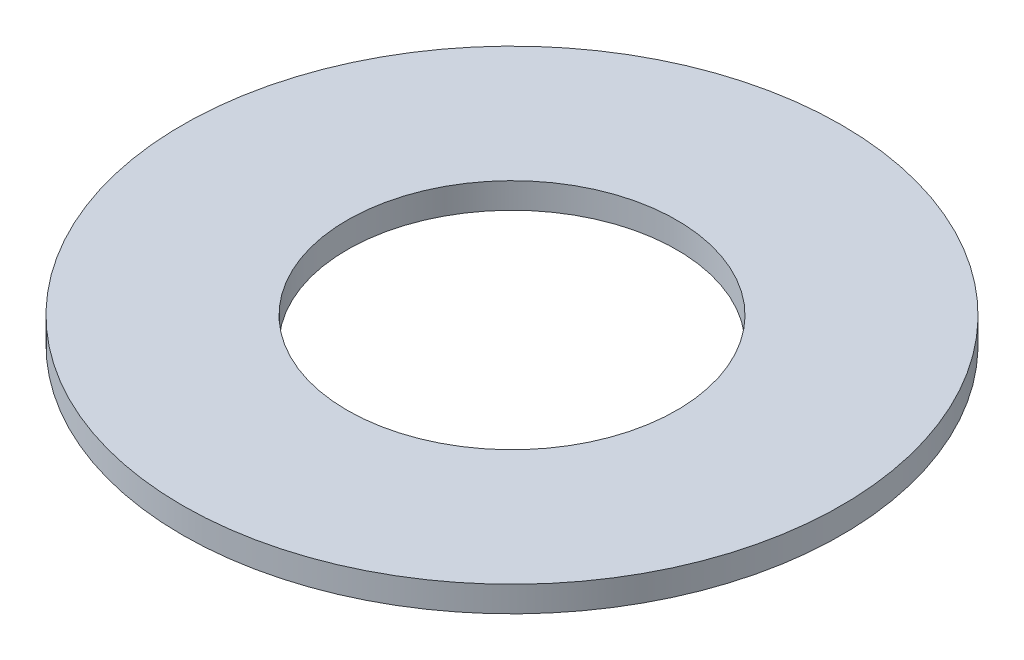
ISO-10303-21;
HEADER;
FILE_DESCRIPTION(('STEP AP214'),'2;1');
FILE_NAME('part.step','',(''),(''),'','','');
FILE_SCHEMA(('AUTOMOTIVE_DESIGN { 1 0 10303 214 1 1 1 1 }'));
ENDSEC;
DATA;
#1=APPLICATION_CONTEXT('core data for automotive mechanical design processes');
#2=APPLICATION_PROTOCOL_DEFINITION('international standard','automotive_design',2000,#1);
#3=PRODUCT_CONTEXT('',#1,'mechanical');
#4=PRODUCT('Part','Part','',(#3));
#5=PRODUCT_RELATED_PRODUCT_CATEGORY('part','',(#4));
#6=PRODUCT_DEFINITION_FORMATION('','',#4);
#7=PRODUCT_DEFINITION_CONTEXT('part definition',#1,'design');
#8=PRODUCT_DEFINITION('design','',#6,#7);
#9=PRODUCT_DEFINITION_SHAPE('','',#8);
#10=(LENGTH_UNIT() NAMED_UNIT(*) SI_UNIT(.MILLI.,.METRE.));
#11=(NAMED_UNIT(*) PLANE_ANGLE_UNIT() SI_UNIT($,.RADIAN.));
#12=(NAMED_UNIT(*) SI_UNIT($,.STERADIAN.) SOLID_ANGLE_UNIT());
#13=UNCERTAINTY_MEASURE_WITH_UNIT(LENGTH_MEASURE(1.E-05),#10,'distance_accuracy_value','');
#14=(GEOMETRIC_REPRESENTATION_CONTEXT(3) GLOBAL_UNCERTAINTY_ASSIGNED_CONTEXT((#13)) GLOBAL_UNIT_ASSIGNED_CONTEXT((#10,
#11,#12)) REPRESENTATION_CONTEXT('',''));
#15=CARTESIAN_POINT('',(0.,0.,0.));
#16=DIRECTION('',(0.,0.,1.));
#17=DIRECTION('',(1.,0.,0.));
#18=AXIS2_PLACEMENT_3D('',#15,#16,#17);
#19=CARTESIAN_POINT('',(0.,7.,0.));
#20=DIRECTION('',(0.,-1.,0.));
#21=DIRECTION('',(0.,0.,-1.));
#22=AXIS2_PLACEMENT_3D('',#19,#20,#21);
#23=CYLINDRICAL_SURFACE('',#22,90.);
#24=CARTESIAN_POINT('',(0.,7.,0.));
#25=DIRECTION('',(0.,1.,0.));
#26=DIRECTION('',(0.,0.,1.));
#27=AXIS2_PLACEMENT_3D('',#24,#25,#26);
#28=CIRCLE('',#27,90.);
#29=CARTESIAN_POINT('',(0.,7.,90.));
#30=VERTEX_POINT('',#29);
#31=EDGE_CURVE('E10',#30,#30,#28,.T.);
#32=ORIENTED_EDGE('',*,*,#31,.F.);
#33=EDGE_LOOP('',(#32));
#34=FACE_BOUND('',#33,.T.);
#35=CARTESIAN_POINT('',(0.,0.,0.));
#36=DIRECTION('',(0.,1.,0.));
#37=DIRECTION('',(0.,0.,1.));
#38=AXIS2_PLACEMENT_3D('',#35,#36,#37);
#39=CIRCLE('',#38,90.);
#40=CARTESIAN_POINT('',(0.,0.,90.));
#41=VERTEX_POINT('',#40);
#42=EDGE_CURVE('E37',#41,#41,#39,.T.);
#43=ORIENTED_EDGE('',*,*,#42,.T.);
#44=EDGE_LOOP('',(#43));
#45=FACE_BOUND('',#44,.T.);
#46=ADVANCED_FACE('F40',(#34,#45),#23,.T.);
#47=CARTESIAN_POINT('',(0.,7.,0.));
#48=DIRECTION('',(0.,1.,0.));
#49=DIRECTION('',(0.,0.,1.));
#50=AXIS2_PLACEMENT_3D('',#47,#48,#49);
#51=PLANE('',#50);
#52=CARTESIAN_POINT('',(0.,7.,0.));
#53=DIRECTION('',(0.,1.,0.));
#54=DIRECTION('',(0.,0.,1.));
#55=AXIS2_PLACEMENT_3D('',#52,#53,#54);
#56=CIRCLE('',#55,45.);
#57=CARTESIAN_POINT('',(0.,7.,45.));
#58=VERTEX_POINT('',#57);
#59=EDGE_CURVE('E50',#58,#58,#56,.T.);
#60=ORIENTED_EDGE('',*,*,#59,.F.);
#61=EDGE_LOOP('',(#60));
#62=FACE_BOUND('',#61,.T.);
#63=ORIENTED_EDGE('',*,*,#31,.T.);
#64=EDGE_LOOP('',(#63));
#65=FACE_BOUND('',#64,.T.);
#66=ADVANCED_FACE('F59',(#62,#65),#51,.T.);
#67=CARTESIAN_POINT('',(0.,0.,0.));
#68=DIRECTION('',(0.,1.,0.));
#69=DIRECTION('',(0.,0.,1.));
#70=AXIS2_PLACEMENT_3D('',#67,#68,#69);
#71=PLANE('',#70);
#72=CARTESIAN_POINT('',(0.,0.,0.));
#73=DIRECTION('',(0.,1.,0.));
#74=DIRECTION('',(0.,0.,1.));
#75=AXIS2_PLACEMENT_3D('',#72,#73,#74);
#76=CIRCLE('',#75,45.);
#77=CARTESIAN_POINT('',(0.,0.,45.));
#78=VERTEX_POINT('',#77);
#79=EDGE_CURVE('E47',#78,#78,#76,.T.);
#80=ORIENTED_EDGE('',*,*,#79,.T.);
#81=EDGE_LOOP('',(#80));
#82=FACE_BOUND('',#81,.T.);
#83=ORIENTED_EDGE('',*,*,#42,.F.);
#84=EDGE_LOOP('',(#83));
#85=FACE_BOUND('',#84,.T.);
#86=ADVANCED_FACE('F58',(#82,#85),#71,.F.);
#87=CARTESIAN_POINT('',(0.,7.,0.));
#88=DIRECTION('',(0.,-1.,0.));
#89=DIRECTION('',(0.,0.,-1.));
#90=AXIS2_PLACEMENT_3D('',#87,#88,#89);
#91=CYLINDRICAL_SURFACE('',#90,45.);
#92=ORIENTED_EDGE('',*,*,#59,.T.);
#93=EDGE_LOOP('',(#92));
#94=FACE_BOUND('',#93,.T.);
#95=ORIENTED_EDGE('',*,*,#79,.F.);
#96=EDGE_LOOP('',(#95));
#97=FACE_BOUND('',#96,.T.);
#98=ADVANCED_FACE('F54',(#94,#97),#91,.F.);
#99=CLOSED_SHELL('',(#46,#66,#86,#98));
#100=MANIFOLD_SOLID_BREP('B2',#99);
#101=ADVANCED_BREP_SHAPE_REPRESENTATION('',(#18,#100),#14);
#102=SHAPE_DEFINITION_REPRESENTATION(#9,#101);
ENDSEC;
END-ISO-10303-21;
